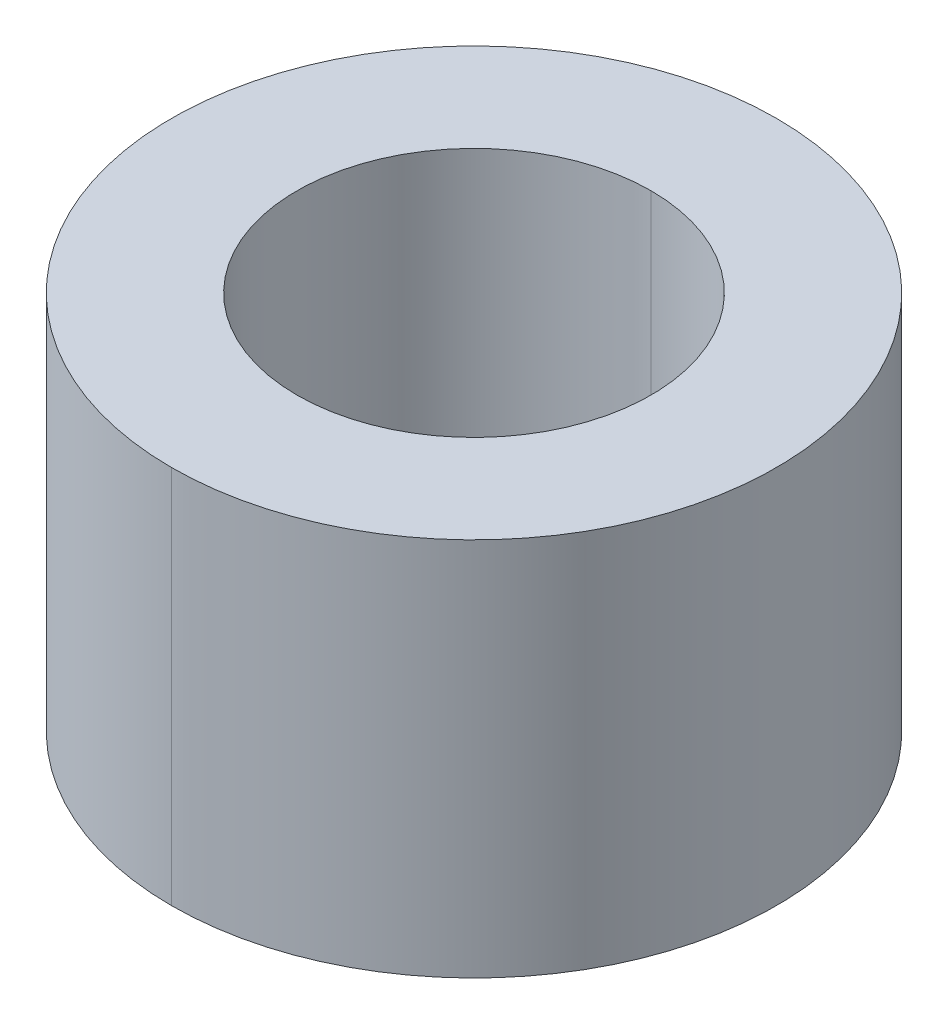
ISO-10303-21;
HEADER;
FILE_DESCRIPTION(('STEP AP214'),'2;1');
FILE_NAME('part.step','',(''),(''),'','','');
FILE_SCHEMA(('AUTOMOTIVE_DESIGN { 1 0 10303 214 1 1 1 1 }'));
ENDSEC;
DATA;
#1=APPLICATION_CONTEXT('core data for automotive mechanical design processes');
#2=APPLICATION_PROTOCOL_DEFINITION('international standard','automotive_design',2000,#1);
#3=PRODUCT_CONTEXT('',#1,'mechanical');
#4=PRODUCT('Part','Part','',(#3));
#5=PRODUCT_RELATED_PRODUCT_CATEGORY('part','',(#4));
#6=PRODUCT_DEFINITION_FORMATION('','',#4);
#7=PRODUCT_DEFINITION_CONTEXT('part definition',#1,'design');
#8=PRODUCT_DEFINITION('design','',#6,#7);
#9=PRODUCT_DEFINITION_SHAPE('','',#8);
#10=(LENGTH_UNIT() NAMED_UNIT(*) SI_UNIT(.MILLI.,.METRE.));
#11=(NAMED_UNIT(*) PLANE_ANGLE_UNIT() SI_UNIT($,.RADIAN.));
#12=(NAMED_UNIT(*) SI_UNIT($,.STERADIAN.) SOLID_ANGLE_UNIT());
#13=UNCERTAINTY_MEASURE_WITH_UNIT(LENGTH_MEASURE(1.E-05),#10,'distance_accuracy_value','');
#14=(GEOMETRIC_REPRESENTATION_CONTEXT(3) GLOBAL_UNCERTAINTY_ASSIGNED_CONTEXT((#13)) GLOBAL_UNIT_ASSIGNED_CONTEXT((#10,
#11,#12)) REPRESENTATION_CONTEXT('',''));
#15=CARTESIAN_POINT('',(0.,0.,0.));
#16=DIRECTION('',(0.,0.,1.));
#17=DIRECTION('',(1.,0.,0.));
#18=AXIS2_PLACEMENT_3D('',#15,#16,#17);
#19=CARTESIAN_POINT('',(0.,23.9,0.));
#20=DIRECTION('',(0.,-1.,0.));
#21=DIRECTION('',(0.,0.,-1.));
#22=AXIS2_PLACEMENT_3D('',#19,#20,#21);
#23=CYLINDRICAL_SURFACE('',#22,11.15);
#24=DIRECTION('',(0.,-1.,0.));
#25=VECTOR('',#24,1.);
#26=CARTESIAN_POINT('',(0.,23.9,11.15));
#27=LINE('',#26,#25);
#28=CARTESIAN_POINT('',(0.,23.9,11.15));
#29=VERTEX_POINT('',#28);
#30=CARTESIAN_POINT('',(0.,0.,11.15));
#31=VERTEX_POINT('',#30);
#32=EDGE_CURVE('E102',#29,#31,#27,.T.);
#33=ORIENTED_EDGE('',*,*,#32,.F.);
#34=CARTESIAN_POINT('',(0.,23.9,0.));
#35=DIRECTION('',(0.,1.,0.));
#36=DIRECTION('',(0.,0.,1.));
#37=AXIS2_PLACEMENT_3D('',#34,#35,#36);
#38=CIRCLE('',#37,11.15);
#39=CARTESIAN_POINT('',(0.,23.9,-11.15));
#40=VERTEX_POINT('',#39);
#41=EDGE_CURVE('E21',#29,#40,#38,.T.);
#42=ORIENTED_EDGE('',*,*,#41,.T.);
#43=DIRECTION('',(0.,-1.,0.));
#44=VECTOR('',#43,1.);
#45=CARTESIAN_POINT('',(0.,23.9,-11.15));
#46=LINE('',#45,#44);
#47=CARTESIAN_POINT('',(0.,0.,-11.15));
#48=VERTEX_POINT('',#47);
#49=EDGE_CURVE('E91',#40,#48,#46,.T.);
#50=ORIENTED_EDGE('',*,*,#49,.T.);
#51=CARTESIAN_POINT('',(0.,0.,0.));
#52=DIRECTION('',(0.,1.,0.));
#53=DIRECTION('',(0.,0.,1.));
#54=AXIS2_PLACEMENT_3D('',#51,#52,#53);
#55=CIRCLE('',#54,11.15);
#56=EDGE_CURVE('E11',#31,#48,#55,.T.);
#57=ORIENTED_EDGE('',*,*,#56,.F.);
#58=EDGE_LOOP('',(#33,#42,#50,#57));
#59=FACE_BOUND('',#58,.T.);
#60=ADVANCED_FACE('F17',(#59),#23,.F.);
#61=CARTESIAN_POINT('',(0.,23.9,0.));
#62=DIRECTION('',(0.,-1.,0.));
#63=DIRECTION('',(0.,0.,-1.));
#64=AXIS2_PLACEMENT_3D('',#61,#62,#63);
#65=CYLINDRICAL_SURFACE('',#64,19.05);
#66=DIRECTION('',(0.,-1.,0.));
#67=VECTOR('',#66,1.);
#68=CARTESIAN_POINT('',(0.,23.9,19.05));
#69=LINE('',#68,#67);
#70=CARTESIAN_POINT('',(0.,23.9,19.05));
#71=VERTEX_POINT('',#70);
#72=CARTESIAN_POINT('',(0.,0.,19.05));
#73=VERTEX_POINT('',#72);
#74=EDGE_CURVE('E82',#71,#73,#69,.T.);
#75=ORIENTED_EDGE('',*,*,#74,.F.);
#76=CARTESIAN_POINT('',(0.,23.9,0.));
#77=DIRECTION('',(0.,1.,0.));
#78=DIRECTION('',(0.,0.,1.));
#79=AXIS2_PLACEMENT_3D('',#76,#77,#78);
#80=CIRCLE('',#79,19.05);
#81=CARTESIAN_POINT('',(0.,23.9,-19.05));
#82=VERTEX_POINT('',#81);
#83=EDGE_CURVE('E73',#82,#71,#80,.T.);
#84=ORIENTED_EDGE('',*,*,#83,.F.);
#85=DIRECTION('',(0.,-1.,0.));
#86=VECTOR('',#85,1.);
#87=CARTESIAN_POINT('',(0.,23.9,-19.05));
#88=LINE('',#87,#86);
#89=CARTESIAN_POINT('',(0.,0.,-19.05));
#90=VERTEX_POINT('',#89);
#91=EDGE_CURVE('E79',#82,#90,#88,.T.);
#92=ORIENTED_EDGE('',*,*,#91,.T.);
#93=CARTESIAN_POINT('',(0.,0.,0.));
#94=DIRECTION('',(0.,1.,0.));
#95=DIRECTION('',(0.,0.,1.));
#96=AXIS2_PLACEMENT_3D('',#93,#94,#95);
#97=CIRCLE('',#96,19.05);
#98=EDGE_CURVE('E27',#90,#73,#97,.T.);
#99=ORIENTED_EDGE('',*,*,#98,.T.);
#100=EDGE_LOOP('',(#75,#84,#92,#99));
#101=FACE_BOUND('',#100,.T.);
#102=ADVANCED_FACE('F83',(#101),#65,.T.);
#103=CARTESIAN_POINT('',(0.,0.,0.));
#104=DIRECTION('',(0.,1.,0.));
#105=DIRECTION('',(1.,0.,0.));
#106=AXIS2_PLACEMENT_3D('',#103,#104,#105);
#107=PLANE('',#106);
#108=CARTESIAN_POINT('',(0.,0.,0.));
#109=DIRECTION('',(0.,1.,0.));
#110=DIRECTION('',(0.,0.,1.));
#111=AXIS2_PLACEMENT_3D('',#108,#109,#110);
#112=CIRCLE('',#111,11.15);
#113=EDGE_CURVE('E98',#48,#31,#112,.T.);
#114=ORIENTED_EDGE('',*,*,#113,.T.);
#115=ORIENTED_EDGE('',*,*,#56,.T.);
#116=EDGE_LOOP('',(#114,#115));
#117=FACE_BOUND('',#116,.T.);
#118=ORIENTED_EDGE('',*,*,#98,.F.);
#119=CARTESIAN_POINT('',(0.,0.,0.));
#120=DIRECTION('',(0.,1.,0.));
#121=DIRECTION('',(0.,0.,1.));
#122=AXIS2_PLACEMENT_3D('',#119,#120,#121);
#123=CIRCLE('',#122,19.05);
#124=EDGE_CURVE('E87',#73,#90,#123,.T.);
#125=ORIENTED_EDGE('',*,*,#124,.F.);
#126=EDGE_LOOP('',(#118,#125));
#127=FACE_BOUND('',#126,.T.);
#128=ADVANCED_FACE('F116',(#117,#127),#107,.F.);
#129=CARTESIAN_POINT('',(0.,23.9,0.));
#130=DIRECTION('',(0.,1.,0.));
#131=DIRECTION('',(1.,0.,0.));
#132=AXIS2_PLACEMENT_3D('',#129,#130,#131);
#133=PLANE('',#132);
#134=CARTESIAN_POINT('',(0.,23.9,0.));
#135=DIRECTION('',(0.,1.,0.));
#136=DIRECTION('',(0.,0.,1.));
#137=AXIS2_PLACEMENT_3D('',#134,#135,#136);
#138=CIRCLE('',#137,11.15);
#139=EDGE_CURVE('E105',#40,#29,#138,.T.);
#140=ORIENTED_EDGE('',*,*,#139,.F.);
#141=ORIENTED_EDGE('',*,*,#41,.F.);
#142=EDGE_LOOP('',(#140,#141));
#143=FACE_BOUND('',#142,.T.);
#144=ORIENTED_EDGE('',*,*,#83,.T.);
#145=CARTESIAN_POINT('',(0.,23.9,0.));
#146=DIRECTION('',(0.,1.,0.));
#147=DIRECTION('',(0.,0.,1.));
#148=AXIS2_PLACEMENT_3D('',#145,#146,#147);
#149=CIRCLE('',#148,19.05);
#150=EDGE_CURVE('E76',#71,#82,#149,.T.);
#151=ORIENTED_EDGE('',*,*,#150,.T.);
#152=EDGE_LOOP('',(#144,#151));
#153=FACE_BOUND('',#152,.T.);
#154=ADVANCED_FACE('F74',(#143,#153),#133,.T.);
#155=CARTESIAN_POINT('',(0.,23.9,0.));
#156=DIRECTION('',(0.,-1.,0.));
#157=DIRECTION('',(0.,0.,-1.));
#158=AXIS2_PLACEMENT_3D('',#155,#156,#157);
#159=CYLINDRICAL_SURFACE('',#158,19.05);
#160=ORIENTED_EDGE('',*,*,#150,.F.);
#161=ORIENTED_EDGE('',*,*,#74,.T.);
#162=ORIENTED_EDGE('',*,*,#124,.T.);
#163=ORIENTED_EDGE('',*,*,#91,.F.);
#164=EDGE_LOOP('',(#160,#161,#162,#163));
#165=FACE_BOUND('',#164,.T.);
#166=ADVANCED_FACE('F89',(#165),#159,.T.);
#167=CARTESIAN_POINT('',(0.,23.9,0.));
#168=DIRECTION('',(0.,-1.,0.));
#169=DIRECTION('',(0.,0.,-1.));
#170=AXIS2_PLACEMENT_3D('',#167,#168,#169);
#171=CYLINDRICAL_SURFACE('',#170,11.15);
#172=ORIENTED_EDGE('',*,*,#139,.T.);
#173=ORIENTED_EDGE('',*,*,#32,.T.);
#174=ORIENTED_EDGE('',*,*,#113,.F.);
#175=ORIENTED_EDGE('',*,*,#49,.F.);
#176=EDGE_LOOP('',(#172,#173,#174,#175));
#177=FACE_BOUND('',#176,.T.);
#178=ADVANCED_FACE('F19',(#177),#171,.F.);
#179=CLOSED_SHELL('',(#60,#102,#128,#154,#166,#178));
#180=MANIFOLD_SOLID_BREP('B1',#179);
#181=ADVANCED_BREP_SHAPE_REPRESENTATION('',(#18,#180),#14);
#182=SHAPE_DEFINITION_REPRESENTATION(#9,#181);
ENDSEC;
END-ISO-10303-21;
